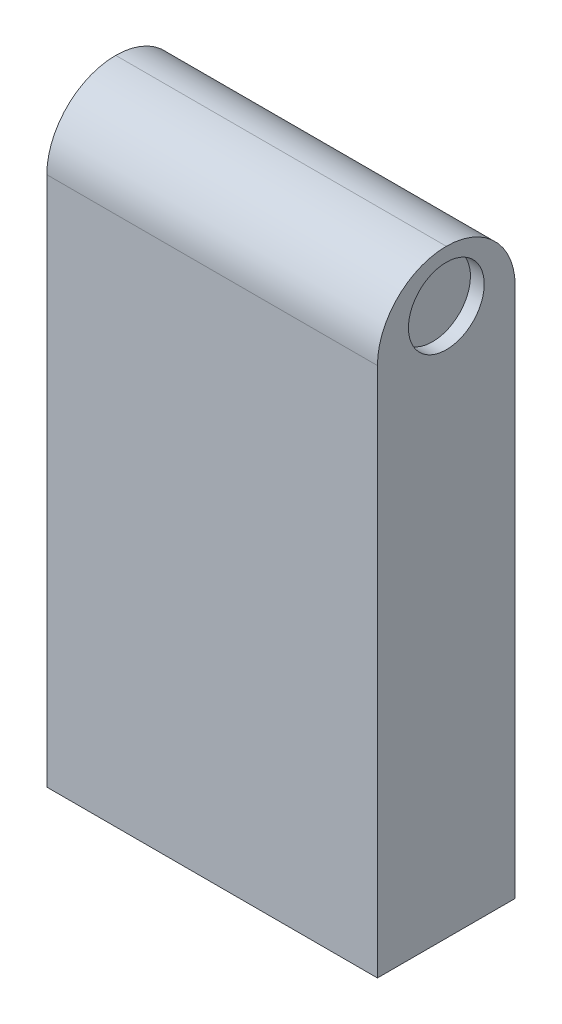
ISO-10303-21;
HEADER;
FILE_DESCRIPTION(('STEP AP214'),'2;1');
FILE_NAME('part.step','',(''),(''),'','','');
FILE_SCHEMA(('AUTOMOTIVE_DESIGN { 1 0 10303 214 1 1 1 1 }'));
ENDSEC;
DATA;
#1=APPLICATION_CONTEXT('core data for automotive mechanical design processes');
#2=APPLICATION_PROTOCOL_DEFINITION('international standard','automotive_design',2000,#1);
#3=PRODUCT_CONTEXT('',#1,'mechanical');
#4=PRODUCT('Part','Part','',(#3));
#5=PRODUCT_RELATED_PRODUCT_CATEGORY('part','',(#4));
#6=PRODUCT_DEFINITION_FORMATION('','',#4);
#7=PRODUCT_DEFINITION_CONTEXT('part definition',#1,'design');
#8=PRODUCT_DEFINITION('design','',#6,#7);
#9=PRODUCT_DEFINITION_SHAPE('','',#8);
#10=(LENGTH_UNIT() NAMED_UNIT(*) SI_UNIT(.MILLI.,.METRE.));
#11=(NAMED_UNIT(*) PLANE_ANGLE_UNIT() SI_UNIT($,.RADIAN.));
#12=(NAMED_UNIT(*) SI_UNIT($,.STERADIAN.) SOLID_ANGLE_UNIT());
#13=UNCERTAINTY_MEASURE_WITH_UNIT(LENGTH_MEASURE(1.E-05),#10,'distance_accuracy_value','');
#14=(GEOMETRIC_REPRESENTATION_CONTEXT(3) GLOBAL_UNCERTAINTY_ASSIGNED_CONTEXT((#13)) GLOBAL_UNIT_ASSIGNED_CONTEXT((#10,
#11,#12)) REPRESENTATION_CONTEXT('',''));
#15=CARTESIAN_POINT('',(0.,0.,0.));
#16=DIRECTION('',(0.,0.,1.));
#17=DIRECTION('',(1.,0.,0.));
#18=AXIS2_PLACEMENT_3D('',#15,#16,#17);
#19=CARTESIAN_POINT('',(0.,0.,10.));
#20=DIRECTION('',(1.,0.,0.));
#21=DIRECTION('',(0.,0.,-1.));
#22=AXIS2_PLACEMENT_3D('',#19,#20,#21);
#23=PLANE('',#22);
#24=CARTESIAN_POINT('',(0.,38.5,5.));
#25=DIRECTION('',(1.,0.,0.));
#26=DIRECTION('',(0.,0.,-1.));
#27=AXIS2_PLACEMENT_3D('',#24,#25,#26);
#28=CIRCLE('',#27,5.);
#29=CARTESIAN_POINT('',(0.,38.5,10.));
#30=VERTEX_POINT('',#29);
#31=CARTESIAN_POINT('',(0.,43.5,5.));
#32=VERTEX_POINT('',#31);
#33=EDGE_CURVE('E102',#30,#32,#28,.F.);
#34=ORIENTED_EDGE('',*,*,#33,.T.);
#35=CARTESIAN_POINT('',(0.,38.5,5.));
#36=DIRECTION('',(1.,0.,0.));
#37=DIRECTION('',(0.,0.,-1.));
#38=AXIS2_PLACEMENT_3D('',#35,#36,#37);
#39=CIRCLE('',#38,5.);
#40=CARTESIAN_POINT('',(0.,38.5,0.));
#41=VERTEX_POINT('',#40);
#42=EDGE_CURVE('E104',#32,#41,#39,.F.);
#43=ORIENTED_EDGE('',*,*,#42,.T.);
#44=DIRECTION('',(0.,-1.,0.));
#45=VECTOR('',#44,1.);
#46=CARTESIAN_POINT('',(0.,0.,0.));
#47=LINE('',#46,#45);
#48=CARTESIAN_POINT('',(0.,0.,0.));
#49=VERTEX_POINT('',#48);
#50=EDGE_CURVE('E100',#41,#49,#47,.T.);
#51=ORIENTED_EDGE('',*,*,#50,.T.);
#52=DIRECTION('',(0.,0.,-1.));
#53=VECTOR('',#52,1.);
#54=CARTESIAN_POINT('',(0.,0.,10.));
#55=LINE('',#54,#53);
#56=CARTESIAN_POINT('',(0.,0.,10.));
#57=VERTEX_POINT('',#56);
#58=EDGE_CURVE('E94',#57,#49,#55,.T.);
#59=ORIENTED_EDGE('',*,*,#58,.F.);
#60=DIRECTION('',(0.,-1.,0.));
#61=VECTOR('',#60,1.);
#62=CARTESIAN_POINT('',(0.,0.,10.));
#63=LINE('',#62,#61);
#64=EDGE_CURVE('E80',#30,#57,#63,.T.);
#65=ORIENTED_EDGE('',*,*,#64,.F.);
#66=EDGE_LOOP('',(#34,#43,#51,#59,#65));
#67=FACE_BOUND('',#66,.T.);
#68=ADVANCED_FACE('F36',(#67),#23,.F.);
#69=CARTESIAN_POINT('',(0.,0.,10.));
#70=DIRECTION('',(0.,1.,0.));
#71=DIRECTION('',(0.,0.,1.));
#72=AXIS2_PLACEMENT_3D('',#69,#70,#71);
#73=PLANE('',#72);
#74=DIRECTION('',(1.,0.,0.));
#75=VECTOR('',#74,1.);
#76=CARTESIAN_POINT('',(0.,0.,0.));
#77=LINE('',#76,#75);
#78=CARTESIAN_POINT('',(24.,0.,0.));
#79=VERTEX_POINT('',#78);
#80=EDGE_CURVE('E121',#49,#79,#77,.T.);
#81=ORIENTED_EDGE('',*,*,#80,.T.);
#82=DIRECTION('',(0.,0.,-1.));
#83=VECTOR('',#82,1.);
#84=CARTESIAN_POINT('',(24.,0.,10.));
#85=LINE('',#84,#83);
#86=CARTESIAN_POINT('',(24.,0.,10.));
#87=VERTEX_POINT('',#86);
#88=EDGE_CURVE('E96',#87,#79,#85,.T.);
#89=ORIENTED_EDGE('',*,*,#88,.F.);
#90=DIRECTION('',(1.,0.,0.));
#91=VECTOR('',#90,1.);
#92=CARTESIAN_POINT('',(0.,0.,10.));
#93=LINE('',#92,#91);
#94=EDGE_CURVE('E83',#57,#87,#93,.T.);
#95=ORIENTED_EDGE('',*,*,#94,.F.);
#96=ORIENTED_EDGE('',*,*,#58,.T.);
#97=EDGE_LOOP('',(#81,#89,#95,#96));
#98=FACE_BOUND('',#97,.T.);
#99=ADVANCED_FACE('F93',(#98),#73,.F.);
#100=CARTESIAN_POINT('',(24.,0.,10.));
#101=DIRECTION('',(-1.,0.,0.));
#102=DIRECTION('',(0.,-1.,0.));
#103=AXIS2_PLACEMENT_3D('',#100,#101,#102);
#104=PLANE('',#103);
#105=CARTESIAN_POINT('',(24.,39.7454234467809,5.00000000000002));
#106=DIRECTION('',(1.,0.,0.));
#107=DIRECTION('',(0.,1.,0.));
#108=AXIS2_PLACEMENT_3D('',#105,#106,#107);
#109=CIRCLE('',#108,2.75);
#110=CARTESIAN_POINT('',(24.,42.4954234467809,5.00000000000002));
#111=VERTEX_POINT('',#110);
#112=EDGE_CURVE('E126',#111,#111,#109,.T.);
#113=ORIENTED_EDGE('',*,*,#112,.F.);
#114=EDGE_LOOP('',(#113));
#115=FACE_BOUND('',#114,.T.);
#116=DIRECTION('',(0.,1.,0.));
#117=VECTOR('',#116,1.);
#118=CARTESIAN_POINT('',(24.,0.,0.));
#119=LINE('',#118,#117);
#120=CARTESIAN_POINT('',(24.,38.5,0.));
#121=VERTEX_POINT('',#120);
#122=EDGE_CURVE('E89',#79,#121,#119,.T.);
#123=ORIENTED_EDGE('',*,*,#122,.T.);
#124=CARTESIAN_POINT('',(24.,38.5,5.));
#125=DIRECTION('',(-1.,0.,0.));
#126=DIRECTION('',(0.,-1.,0.));
#127=AXIS2_PLACEMENT_3D('',#124,#125,#126);
#128=CIRCLE('',#127,5.);
#129=CARTESIAN_POINT('',(24.,43.5,5.));
#130=VERTEX_POINT('',#129);
#131=EDGE_CURVE('E45',#121,#130,#128,.F.);
#132=ORIENTED_EDGE('',*,*,#131,.T.);
#133=CARTESIAN_POINT('',(24.,38.5,5.));
#134=DIRECTION('',(-1.,0.,0.));
#135=DIRECTION('',(0.,-1.,0.));
#136=AXIS2_PLACEMENT_3D('',#133,#134,#135);
#137=CIRCLE('',#136,5.);
#138=CARTESIAN_POINT('',(24.,38.5,10.));
#139=VERTEX_POINT('',#138);
#140=EDGE_CURVE('E52',#130,#139,#137,.F.);
#141=ORIENTED_EDGE('',*,*,#140,.T.);
#142=DIRECTION('',(0.,1.,0.));
#143=VECTOR('',#142,1.);
#144=CARTESIAN_POINT('',(24.,0.,10.));
#145=LINE('',#144,#143);
#146=EDGE_CURVE('E97',#87,#139,#145,.T.);
#147=ORIENTED_EDGE('',*,*,#146,.F.);
#148=ORIENTED_EDGE('',*,*,#88,.T.);
#149=EDGE_LOOP('',(#123,#132,#141,#147,#148));
#150=FACE_BOUND('',#149,.T.);
#151=ADVANCED_FACE('F120',(#115,#150),#104,.F.);
#152=CARTESIAN_POINT('',(0.,0.,10.));
#153=DIRECTION('',(0.,0.,-1.));
#154=DIRECTION('',(-1.,0.,0.));
#155=AXIS2_PLACEMENT_3D('',#152,#153,#154);
#156=PLANE('',#155);
#157=ORIENTED_EDGE('',*,*,#146,.T.);
#158=DIRECTION('',(-1.,0.,0.));
#159=VECTOR('',#158,1.);
#160=CARTESIAN_POINT('',(0.,38.5,10.));
#161=LINE('',#160,#159);
#162=EDGE_CURVE('E11',#139,#30,#161,.T.);
#163=ORIENTED_EDGE('',*,*,#162,.T.);
#164=ORIENTED_EDGE('',*,*,#64,.T.);
#165=ORIENTED_EDGE('',*,*,#94,.T.);
#166=EDGE_LOOP('',(#157,#163,#164,#165));
#167=FACE_BOUND('',#166,.T.);
#168=ADVANCED_FACE('F82',(#167),#156,.F.);
#169=CARTESIAN_POINT('',(0.,0.,0.));
#170=DIRECTION('',(0.,0.,-1.));
#171=DIRECTION('',(-1.,0.,0.));
#172=AXIS2_PLACEMENT_3D('',#169,#170,#171);
#173=PLANE('',#172);
#174=ORIENTED_EDGE('',*,*,#50,.F.);
#175=DIRECTION('',(-1.,0.,0.));
#176=VECTOR('',#175,1.);
#177=CARTESIAN_POINT('',(24.,38.5,0.));
#178=LINE('',#177,#176);
#179=EDGE_CURVE('E110',#41,#121,#178,.F.);
#180=ORIENTED_EDGE('',*,*,#179,.T.);
#181=ORIENTED_EDGE('',*,*,#122,.F.);
#182=ORIENTED_EDGE('',*,*,#80,.F.);
#183=EDGE_LOOP('',(#174,#180,#181,#182));
#184=FACE_BOUND('',#183,.T.);
#185=ADVANCED_FACE('F117',(#184),#173,.T.);
#186=CARTESIAN_POINT('',(0.,38.5,5.));
#187=DIRECTION('',(-1.,0.,0.));
#188=DIRECTION('',(0.,0.,1.));
#189=AXIS2_PLACEMENT_3D('',#186,#187,#188);
#190=CYLINDRICAL_SURFACE('',#189,5.);
#191=ORIENTED_EDGE('',*,*,#162,.F.);
#192=ORIENTED_EDGE('',*,*,#140,.F.);
#193=DIRECTION('',(-1.,0.,0.));
#194=VECTOR('',#193,1.);
#195=CARTESIAN_POINT('',(0.,43.5,5.));
#196=LINE('',#195,#194);
#197=EDGE_CURVE('E40',#32,#130,#196,.F.);
#198=ORIENTED_EDGE('',*,*,#197,.F.);
#199=ORIENTED_EDGE('',*,*,#33,.F.);
#200=EDGE_LOOP('',(#191,#192,#198,#199));
#201=FACE_BOUND('',#200,.T.);
#202=ADVANCED_FACE('F38',(#201),#190,.T.);
#203=CARTESIAN_POINT('',(0.,38.5,5.));
#204=DIRECTION('',(1.,0.,0.));
#205=DIRECTION('',(0.,0.,-1.));
#206=AXIS2_PLACEMENT_3D('',#203,#204,#205);
#207=CYLINDRICAL_SURFACE('',#206,5.);
#208=ORIENTED_EDGE('',*,*,#131,.F.);
#209=ORIENTED_EDGE('',*,*,#179,.F.);
#210=ORIENTED_EDGE('',*,*,#42,.F.);
#211=ORIENTED_EDGE('',*,*,#197,.T.);
#212=EDGE_LOOP('',(#208,#209,#210,#211));
#213=FACE_BOUND('',#212,.T.);
#214=ADVANCED_FACE('F135',(#213),#207,.T.);
#215=CARTESIAN_POINT('',(23.,39.7454234467809,5.00000000000002));
#216=DIRECTION('',(1.,0.,0.));
#217=DIRECTION('',(0.,1.,0.));
#218=AXIS2_PLACEMENT_3D('',#215,#216,#217);
#219=CYLINDRICAL_SURFACE('',#218,2.75);
#220=CARTESIAN_POINT('',(23.,39.7454234467809,5.00000000000002));
#221=DIRECTION('',(1.,0.,0.));
#222=DIRECTION('',(0.,1.,0.));
#223=AXIS2_PLACEMENT_3D('',#220,#221,#222);
#224=CIRCLE('',#223,2.75);
#225=CARTESIAN_POINT('',(23.,42.4954234467809,5.00000000000002));
#226=VERTEX_POINT('',#225);
#227=EDGE_CURVE('E129',#226,#226,#224,.T.);
#228=ORIENTED_EDGE('',*,*,#227,.F.);
#229=EDGE_LOOP('',(#228));
#230=FACE_BOUND('',#229,.T.);
#231=ORIENTED_EDGE('',*,*,#112,.T.);
#232=EDGE_LOOP('',(#231));
#233=FACE_BOUND('',#232,.T.);
#234=ADVANCED_FACE('F142',(#230,#233),#219,.F.);
#235=CARTESIAN_POINT('',(23.,39.7454234467809,5.00000000000002));
#236=DIRECTION('',(1.,0.,0.));
#237=DIRECTION('',(0.,1.,0.));
#238=AXIS2_PLACEMENT_3D('',#235,#236,#237);
#239=PLANE('',#238);
#240=ORIENTED_EDGE('',*,*,#227,.T.);
#241=EDGE_LOOP('',(#240));
#242=FACE_BOUND('',#241,.T.);
#243=ADVANCED_FACE('F158',(#242),#239,.T.);
#244=CLOSED_SHELL('',(#68,#99,#151,#168,#185,#202,#214,#234,#243));
#245=MANIFOLD_SOLID_BREP('B2',#244);
#246=ADVANCED_BREP_SHAPE_REPRESENTATION('',(#18,#245),#14);
#247=SHAPE_DEFINITION_REPRESENTATION(#9,#246);
ENDSEC;
END-ISO-10303-21;
